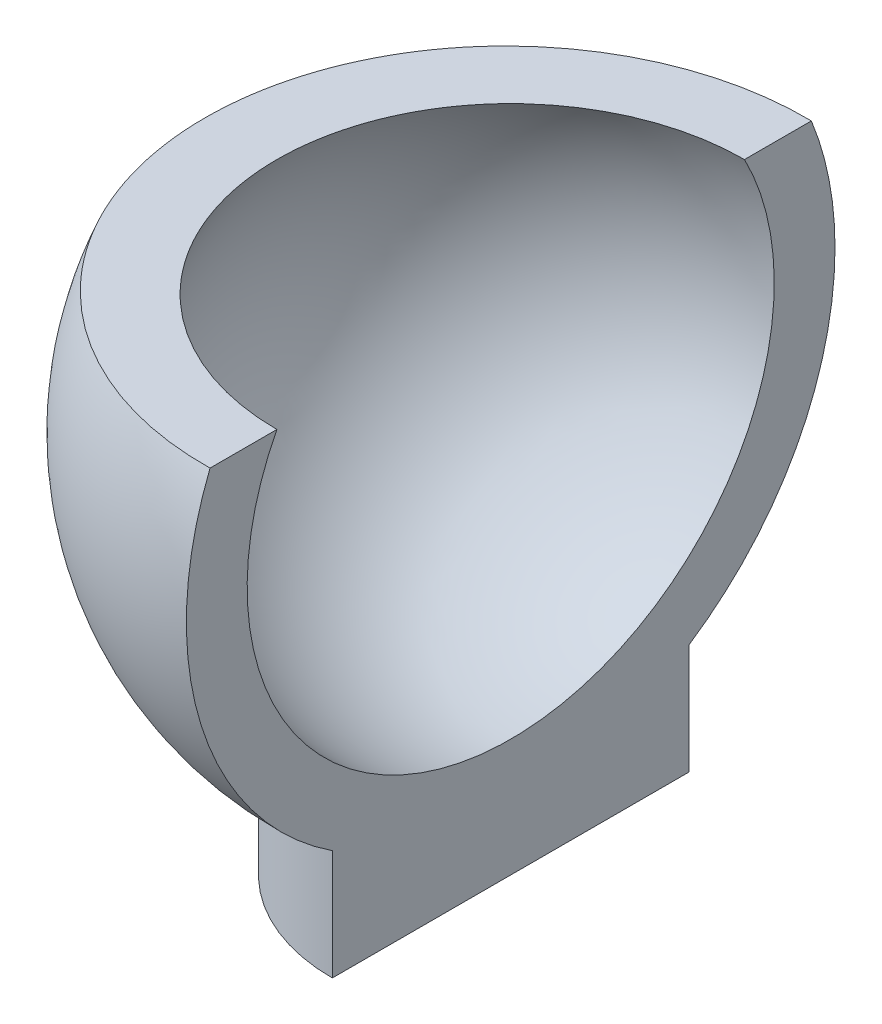
ISO-10303-21;
HEADER;
FILE_DESCRIPTION(('STEP AP214'),'2;1');
FILE_NAME('part.step','',(''),(''),'','','');
FILE_SCHEMA(('AUTOMOTIVE_DESIGN { 1 0 10303 214 1 1 1 1 }'));
ENDSEC;
DATA;
#1=APPLICATION_CONTEXT('core data for automotive mechanical design processes');
#2=APPLICATION_PROTOCOL_DEFINITION('international standard','automotive_design',2000,#1);
#3=PRODUCT_CONTEXT('',#1,'mechanical');
#4=PRODUCT('Part','Part','',(#3));
#5=PRODUCT_RELATED_PRODUCT_CATEGORY('part','',(#4));
#6=PRODUCT_DEFINITION_FORMATION('','',#4);
#7=PRODUCT_DEFINITION_CONTEXT('part definition',#1,'design');
#8=PRODUCT_DEFINITION('design','',#6,#7);
#9=PRODUCT_DEFINITION_SHAPE('','',#8);
#10=(LENGTH_UNIT() NAMED_UNIT(*) SI_UNIT(.MILLI.,.METRE.));
#11=(NAMED_UNIT(*) PLANE_ANGLE_UNIT() SI_UNIT($,.RADIAN.));
#12=(NAMED_UNIT(*) SI_UNIT($,.STERADIAN.) SOLID_ANGLE_UNIT());
#13=UNCERTAINTY_MEASURE_WITH_UNIT(LENGTH_MEASURE(1.E-05),#10,'distance_accuracy_value','');
#14=(GEOMETRIC_REPRESENTATION_CONTEXT(3) GLOBAL_UNCERTAINTY_ASSIGNED_CONTEXT((#13)) GLOBAL_UNIT_ASSIGNED_CONTEXT((#10,
#11,#12)) REPRESENTATION_CONTEXT('',''));
#15=CARTESIAN_POINT('',(0.,0.,0.));
#16=DIRECTION('',(0.,0.,1.));
#17=DIRECTION('',(1.,0.,0.));
#18=AXIS2_PLACEMENT_3D('',#15,#16,#17);
#19=CARTESIAN_POINT('',(-0.318469420270132,0.,0.));
#20=DIRECTION('',(-1.,0.,0.));
#21=DIRECTION('',(0.,0.,-1.));
#22=AXIS2_PLACEMENT_3D('',#19,#20,#21);
#23=SPHERICAL_SURFACE('',#22,20.);
#24=CARTESIAN_POINT('',(-0.318469420270132,7.5,0.));
#25=DIRECTION('',(0.,1.,0.));
#26=DIRECTION('',(0.,0.,1.));
#27=AXIS2_PLACEMENT_3D('',#24,#25,#26);
#28=CIRCLE('',#27,18.5404962177392);
#29=CARTESIAN_POINT('',(0.,7.5,-18.53776084721));
#30=VERTEX_POINT('',#29);
#31=CARTESIAN_POINT('',(0.,7.5,18.53776084721));
#32=VERTEX_POINT('',#31);
#33=EDGE_CURVE('E85',#30,#32,#28,.T.);
#34=ORIENTED_EDGE('',*,*,#33,.F.);
#35=CARTESIAN_POINT('',(0.,0.,0.));
#36=DIRECTION('',(-1.,0.,0.));
#37=DIRECTION('',(0.,0.,1.));
#38=AXIS2_PLACEMENT_3D('',#35,#36,#37);
#39=CIRCLE('',#38,19.9974642699607);
#40=CARTESIAN_POINT('',(0.,-16.7002568012696,-11.));
#41=VERTEX_POINT('',#40);
#42=EDGE_CURVE('E79',#30,#41,#39,.T.);
#43=ORIENTED_EDGE('',*,*,#42,.T.);
#44=CARTESIAN_POINT('',(10.4486910905099,-16.4998,3.43872861608761));
#45=CARTESIAN_POINT('',(10.3520099832137,-16.5016660675455,3.73260385765806));
#46=CARTESIAN_POINT('',(10.2428717104174,-16.5037722891326,4.02237271646154));
#47=CARTESIAN_POINT('',(10.0005990145659,-16.5084467140785,4.59167935130273));
#48=CARTESIAN_POINT('',(9.8674657602793,-16.5110148949357,4.87121762486325));
#49=CARTESIAN_POINT('',(9.57821442973688,-16.5165931160298,5.41787961061132));
#50=CARTESIAN_POINT('',(9.42211274310275,-16.5196028411887,5.68501199792606));
#51=CARTESIAN_POINT('',(9.0879761495767,-16.5260431628054,6.20517762148084));
#52=CARTESIAN_POINT('',(8.90994150481221,-16.5294737542332,6.45821102616962));
#53=CARTESIAN_POINT('',(8.53311257688292,-16.536732433185,6.94849864948354));
#54=CARTESIAN_POINT('',(8.33430864241363,-16.540560705503,7.18574544763739));
#55=CARTESIAN_POINT('',(7.91742485755524,-16.5485853751575,7.64264483067634));
#56=CARTESIAN_POINT('',(7.69934500212475,-16.5527817725904,7.86229741095986));
#57=CARTESIAN_POINT('',(7.24550409597118,-16.5615112018977,8.28240715241219));
#58=CARTESIAN_POINT('',(7.00974645052565,-16.566044168937,8.48286799363849));
#59=CARTESIAN_POINT('',(6.52219028333347,-16.5754144098355,8.86321768096938));
#60=CARTESIAN_POINT('',(6.27039183270186,-16.5802516823456,9.04310661826722));
#61=CARTESIAN_POINT('',(5.75250380402007,-16.5901961666031,9.38106176216871));
#62=CARTESIAN_POINT('',(5.48641208158701,-16.5953034188531,9.53912468149798));
#63=CARTESIAN_POINT('',(4.94186328418899,-16.6057502040994,9.83227363910732));
#64=CARTESIAN_POINT('',(4.66340618668138,-16.6110897375193,9.96735963549719));
#65=CARTESIAN_POINT('',(4.09606315014395,-16.621963334255,10.2136140015553));
#66=CARTESIAN_POINT('',(3.8071756361832,-16.6274974269449,10.3247787414696));
#67=CARTESIAN_POINT('',(3.22106542257375,-16.6387195129622,10.5223752038536));
#68=CARTESIAN_POINT('',(2.92384272576658,-16.6444075062371,10.6088069347547));
#69=CARTESIAN_POINT('',(2.32313838200115,-16.6558972489325,10.7563326448529));
#70=CARTESIAN_POINT('',(2.0196559838272,-16.6616990120022,10.8174235641532));
#71=CARTESIAN_POINT('',(1.40862446542454,-16.6733740937544,10.9138187648366));
#72=CARTESIAN_POINT('',(1.1010753445032,-16.6792474124493,10.9491230418277));
#73=CARTESIAN_POINT('',(0.484115889868616,-16.6910233263341,10.9936928383378));
#74=CARTESIAN_POINT('',(0.174705673000839,-16.696925919682,11.002959975798));
#75=CARTESIAN_POINT('',(-0.443795718501033,-16.7087187637856,10.9953942932697));
#76=CARTESIAN_POINT('',(-0.752886893148376,-16.7146090145417,10.978561474365));
#77=CARTESIAN_POINT('',(-1.3685852901587,-16.7263360226243,10.9189122561017));
#78=CARTESIAN_POINT('',(-1.67519225112046,-16.7321727743296,10.8760931574155));
#79=CARTESIAN_POINT('',(-2.28370988979444,-16.743750902155,10.7647731339014));
#80=CARTESIAN_POINT('',(-2.58562056691049,-16.749492278263,10.6962722058133));
#81=CARTESIAN_POINT('',(-3.18260525764254,-16.7608393084394,10.5340733127363));
#82=CARTESIAN_POINT('',(-3.47767912854026,-16.7664449596747,10.4403748222623));
#83=CARTESIAN_POINT('',(-4.05888541093351,-16.7774810221449,10.2284469860156));
#84=CARTESIAN_POINT('',(-4.34501782288489,-16.7829114333888,10.1102176414936));
#85=CARTESIAN_POINT('',(-4.90629471890557,-16.7935587426303,9.85007334471878));
#86=CARTESIAN_POINT('',(-5.18143965459545,-16.7987756494039,9.70815936722488));
#87=CARTESIAN_POINT('',(-5.71879716220215,-16.8089597297368,9.40165060926966));
#88=CARTESIAN_POINT('',(-5.98100973427018,-16.8139269032989,9.23705582907355));
#89=CARTESIAN_POINT('',(-6.49063565710455,-16.8235768629414,8.88635613533882));
#90=CARTESIAN_POINT('',(-6.73804910295006,-16.8282596508489,8.70025136001687));
#91=CARTESIAN_POINT('',(-7.21631836733921,-16.8373083109268,8.30785342870468));
#92=CARTESIAN_POINT('',(-7.44717418767978,-16.8416741831317,8.10156027490542));
#93=CARTESIAN_POINT('',(-7.8906563429622,-16.8500581692213,7.67028028398163));
#94=CARTESIAN_POINT('',(-8.10328506943565,-16.8540763287293,7.44529590693729));
#95=CARTESIAN_POINT('',(-8.50883410247821,-16.8617377169598,6.97820909767695));
#96=CARTESIAN_POINT('',(-8.70175441040194,-16.865380945708,6.73610666663752));
#97=CARTESIAN_POINT('',(-9.06651386462534,-16.8722673022126,6.23650457808338));
#98=CARTESIAN_POINT('',(-9.23835299298679,-16.8755104296284,5.97900490746725));
#99=CARTESIAN_POINT('',(-9.55972680020424,-16.8815742076838,5.45043935237423));
#100=CARTESIAN_POINT('',(-9.70926148162447,-16.8843948583721,5.17937346945698));
#101=CARTESIAN_POINT('',(-9.9849377666958,-16.8895937983234,4.62565156724651));
#102=CARTESIAN_POINT('',(-10.1110834598625,-16.8919721649192,4.34299758468201));
#103=CARTESIAN_POINT('',(-10.3391162856015,-16.8962707894624,3.76806463740849));
#104=CARTESIAN_POINT('',(-10.4410034209142,-16.8981910474616,3.47578567378682));
#105=CARTESIAN_POINT('',(-10.6197938026897,-16.9015602599419,2.88368130908519));
#106=CARTESIAN_POINT('',(-10.6966970746312,-16.9030092149037,2.58385591570148));
#107=CARTESIAN_POINT('',(-10.8249724111361,-16.9054258765414,1.97879052527897));
#108=CARTESIAN_POINT('',(-10.8763444775881,-16.9063935832529,1.67355052864074));
#109=CARTESIAN_POINT('',(-10.9531862992757,-16.9078410075007,1.05986968490491));
#110=CARTESIAN_POINT('',(-10.9786596779469,-16.9083207933009,0.75142929167029));
#111=CARTESIAN_POINT('',(-11.0035354487566,-16.908789323739,0.133498621511905));
#112=CARTESIAN_POINT('',(-11.0029378435888,-16.9087780684275,-0.175991655303387));
#113=CARTESIAN_POINT('',(-10.9756759096898,-16.9082645940349,-0.793821462876034));
#114=CARTESIAN_POINT('',(-10.9490115917817,-16.9077623751578,-1.10216099411113));
#115=CARTESIAN_POINT('',(-10.869806034012,-16.9062704176933,-1.71549714916166));
#116=CARTESIAN_POINT('',(-10.8172647942037,-16.9052806791069,-2.02049377298399));
#117=CARTESIAN_POINT('',(-10.6866823927888,-16.9028205288884,-2.62496157383));
#118=CARTESIAN_POINT('',(-10.6086424199275,-16.901350139664,-2.92443300774932));
#119=CARTESIAN_POINT('',(-10.4276172303115,-16.8979387667137,-3.51573623907389));
#120=CARTESIAN_POINT('',(-10.324632014827,-16.8959977830118,-3.80756803686811));
#121=CARTESIAN_POINT('',(-10.0944490652742,-16.8916585513587,-4.38151786109732));
#122=CARTESIAN_POINT('',(-9.96725131988663,-16.8892603031939,-4.66363588299111));
#123=CARTESIAN_POINT('',(-9.68954829059844,-16.8840230317175,-5.21615303546429));
#124=CARTESIAN_POINT('',(-9.53904300502315,-16.8811840083742,-5.48655216520169));
#125=CARTESIAN_POINT('',(-9.21578463096101,-16.8750845243206,-6.01372784638748));
#126=CARTESIAN_POINT('',(-9.04303004552077,-16.8718240352536,-6.27050347959168));
#127=CARTESIAN_POINT('',(-8.67650983423113,-16.8649042484251,-6.76858799373889));
#128=CARTESIAN_POINT('',(-8.48274420790317,-16.8612449506547,-7.00989687432962));
#129=CARTESIAN_POINT('',(-8.07558020246493,-16.853552821479,-7.47533328335196));
#130=CARTESIAN_POINT('',(-7.86218184242896,-16.8495199904368,-7.69946082847583));
#131=CARTESIAN_POINT('',(-7.41726965204664,-16.8411086940044,-8.12894281901709));
#132=CARTESIAN_POINT('',(-7.1857558196905,-16.836730228576,-8.33429726235173));
#133=CARTESIAN_POINT('',(-6.70622263113865,-16.8276573376337,-8.72480396613765));
#134=CARTESIAN_POINT('',(-6.45820080190027,-16.822962864778,-8.90995318865352));
#135=CARTESIAN_POINT('',(-5.94744625089713,-16.8132911747974,-9.25869896832882));
#136=CARTESIAN_POINT('',(-5.68471352782633,-16.8083139576473,-9.42229552357478));
#137=CARTESIAN_POINT('',(-5.14640352441548,-16.798111427797,-9.72677503874337));
#138=CARTESIAN_POINT('',(-4.87082617205261,-16.7928861137056,-9.86765787128513));
#139=CARTESIAN_POINT('',(-4.30878713948868,-16.782223914907,-10.1257085148584));
#140=CARTESIAN_POINT('',(-4.02232545801481,-16.7767870301751,-10.2428763231167));
#141=CARTESIAN_POINT('',(-3.44050223296918,-16.7657387922299,-10.4526836562041));
#142=CARTESIAN_POINT('',(-3.14513912416919,-16.7601274083272,-10.5453188388522));
#143=CARTESIAN_POINT('',(-2.54766110912213,-16.748770515582,-10.7053758675295));
#144=CARTESIAN_POINT('',(-2.24554620210348,-16.7430250067243,-10.7727977106772));
#145=CARTESIAN_POINT('',(-1.63671609550183,-16.731440428984,-10.8819486386248));
#146=CARTESIAN_POINT('',(-1.33000095610911,-16.7256013613257,-10.9236780592889));
#147=CARTESIAN_POINT('',(-0.714146537759701,-16.7138708651346,-10.9811492859176));
#148=CARTESIAN_POINT('',(-0.405007258785045,-16.7079794366014,-10.9968910916895));
#149=CARTESIAN_POINT('',(0.213532674233275,-16.6961853353722,-11.0022756535453));
#150=CARTESIAN_POINT('',(0.522933353489004,-16.6902826615002,-10.9919155113116));
#151=CARTESIAN_POINT('',(1.13976234949737,-16.6785087156003,-10.9451636698207));
#152=CARTESIAN_POINT('',(1.44719066575797,-16.6726374435804,-10.9087719640699));
#153=CARTESIAN_POINT('',(2.05789829867899,-16.6609680366465,-10.8102140010129));
#154=CARTESIAN_POINT('',(2.36117749380162,-16.6551699038755,-10.7480469903483));
#155=CARTESIAN_POINT('',(2.96142125439994,-16.6436884724156,-10.5983799370239));
#156=CARTESIAN_POINT('',(3.25838582392825,-16.6380051736531,-10.5108799106228));
#157=CARTESIAN_POINT('',(3.84388957225686,-16.6267942215232,-10.3111681201724));
#158=CARTESIAN_POINT('',(4.13242873475546,-16.6212665684569,-10.1989563083137));
#159=CARTESIAN_POINT('',(4.69903000528824,-16.6104067378104,-9.9506177944535));
#160=CARTESIAN_POINT('',(4.97709208412435,-16.6050745607748,-9.81449102581059));
#161=CARTESIAN_POINT('',(5.52075881460794,-16.5946442782144,-9.5192909763738));
#162=CARTESIAN_POINT('',(5.78636355213812,-16.5895461710758,-9.36021785380619));
#163=CARTESIAN_POINT('',(6.30322539774932,-16.5796210083792,-9.02025654221474));
#164=CARTESIAN_POINT('',(6.55448267310545,-16.574793949661,-8.83936860760338));
#165=CARTESIAN_POINT('',(7.04088092854326,-16.5654456188017,-8.45704976555997));
#166=CARTESIAN_POINT('',(7.27602086489207,-16.5609243664643,-8.2556175298097));
#167=CARTESIAN_POINT('',(7.72849669721531,-16.5522208917737,-7.83364760966612));
#168=CARTESIAN_POINT('',(7.94583239766744,-16.5480386731438,-7.61310971551327));
#169=CARTESIAN_POINT('',(8.36109707607647,-16.5400449130939,-7.15455940115801));
#170=CARTESIAN_POINT('',(8.55903063703988,-16.5362332841383,-6.91655113099988));
#171=CARTESIAN_POINT('',(8.93411995155831,-16.5290079037086,-6.42472626270363));
#172=CARTESIAN_POINT('',(9.11127951094772,-16.5255940793569,-6.17091257323262));
#173=CARTESIAN_POINT('',(9.40026441544679,-16.5200238897408,-5.71728382909163));
#174=CARTESIAN_POINT('',(9.51708571530023,-16.517771648658,-5.52063038839268));
#175=CARTESIAN_POINT('',(9.73824866419202,-16.5135069854942,-5.12042679288211));
#176=CARTESIAN_POINT('',(9.84259108842962,-16.5114945485165,-4.9168770674832));
#177=CARTESIAN_POINT('',(10.0382688967867,-16.5077199348344,-4.50391941420344));
#178=CARTESIAN_POINT('',(10.1296197512353,-16.5059574604823,-4.29451881531439));
#179=CARTESIAN_POINT('',(10.2991369791872,-16.5026864327178,-3.87039995169055));
#180=CARTESIAN_POINT('',(10.3773008767033,-16.5011779269909,-3.65568069698354));
#181=CARTESIAN_POINT('',(10.4486910905099,-16.4998,-3.43872861608745));
#182=B_SPLINE_CURVE_WITH_KNOTS('',3,(#44,#45,#46,#47,#48,#49,#50,#51,#52,#53,#54,#55,#56,#57,
#58,#59,#60,#61,#62,#63,#64,#65,#66,#67,#68,#69,#70,#71,#72,#73,#74,#75,#76,#77,#78,#79,#80,#81,
#82,#83,#84,#85,#86,#87,#88,#89,#90,#91,#92,#93,#94,#95,#96,#97,#98,#99,#100,#101,#102,#103,
#104,#105,#106,#107,#108,#109,#110,#111,#112,#113,#114,#115,#116,#117,#118,#119,#120,#121,#122,
#123,#124,#125,#126,#127,#128,#129,#130,#131,#132,#133,#134,#135,#136,#137,#138,#139,#140,#141,
#142,#143,#144,#145,#146,#147,#148,#149,#150,#151,#152,#153,#154,#155,#156,#157,#158,#159,#160,
#161,#162,#163,#164,#165,#166,#167,#168,#169,#170,#171,#172,#173,#174,#175,#176,#177,#178,#179,
#180,#181),.UNSPECIFIED.,.F.,.F.,(4,2,2,2,2,2,2,2,2,2,2,2,2,2,2,2,2,2,2,2,2,2,2,2,2,2,2,2,2,2,2,
2,2,2,2,2,2,2,2,2,2,2,2,2,2,2,2,2,2,2,2,2,2,2,2,2,2,2,2,2,2,2,2,2,2,2,2,2,4),(0.,
0.927843860370731,1.85564253871705,2.78278234845758,3.70991107874351,4.63747257018442,
5.5650343042185,6.49241781854272,7.41979722170599,8.34731614794359,9.27483676516145,
10.2024980230381,11.1301589646726,12.0579318885529,12.9857049704517,13.91342039949,
14.8411357900027,15.7689475635491,16.6967594548774,17.6245906968549,18.5524218915296,
19.4802149100238,20.4080079176697,21.3357949639321,22.2635819095047,23.1912469355407,
24.1189118978158,25.0465776494469,25.974243294429,26.9017465857402,27.8292497722707,
28.7567520129226,29.684254184961,30.61162657409,31.5389988674037,32.4663707756706,
33.3937426820275,34.3210713606843,35.2483999921254,36.1757290570883,37.1030581886793,
38.0304497444541,38.9578413213519,39.8852319972454,40.8126227760272,41.740152800151,
42.6676829066212,43.5952182145935,44.5227536310316,45.4504531081423,46.37815269127,
47.3058401467805,48.2335276091697,49.1613180849998,50.0891087922684,51.0169266188301,
51.9447438499175,52.8725628760531,53.8003844876913,54.7281997018534,55.6560040965343,
56.583868517677,57.5117431270622,58.4393980310464,59.3668827205889,60.0527055224225,
60.7384856981572,61.423442285364,62.1085273374436),.UNSPECIFIED.);
#183=CARTESIAN_POINT('',(0.,-16.7002568012696,11.));
#184=VERTEX_POINT('',#183);
#185=EDGE_CURVE('E42',#184,#41,#182,.T.);
#186=ORIENTED_EDGE('',*,*,#185,.F.);
#187=EDGE_CURVE('E120',#184,#32,#39,.T.);
#188=ORIENTED_EDGE('',*,*,#187,.T.);
#189=EDGE_LOOP('',(#34,#43,#186,#188));
#190=FACE_BOUND('',#189,.T.);
#191=ADVANCED_FACE('F34',(#190),#23,.T.);
#192=CARTESIAN_POINT('',(0.,7.5,0.));
#193=DIRECTION('',(0.,1.,0.));
#194=DIRECTION('',(0.,0.,1.));
#195=AXIS2_PLACEMENT_3D('',#192,#193,#194);
#196=PLANE('',#195);
#197=DIRECTION('',(0.,0.,1.));
#198=VECTOR('',#197,1.);
#199=CARTESIAN_POINT('',(0.,7.5,0.));
#200=LINE('',#199,#198);
#201=CARTESIAN_POINT('',(0.,7.5,-14.4157032433385));
#202=VERTEX_POINT('',#201);
#203=EDGE_CURVE('E112',#30,#202,#200,.T.);
#204=ORIENTED_EDGE('',*,*,#203,.F.);
#205=ORIENTED_EDGE('',*,*,#33,.T.);
#206=CARTESIAN_POINT('',(0.,7.5,14.4157032433385));
#207=VERTEX_POINT('',#206);
#208=EDGE_CURVE('E118',#207,#32,#200,.T.);
#209=ORIENTED_EDGE('',*,*,#208,.F.);
#210=CARTESIAN_POINT('',(0.,7.5,0.));
#211=DIRECTION('',(0.,1.,0.));
#212=DIRECTION('',(0.,0.,1.));
#213=AXIS2_PLACEMENT_3D('',#210,#211,#212);
#214=CIRCLE('',#213,14.4157032433385);
#215=EDGE_CURVE('E82',#202,#207,#214,.T.);
#216=ORIENTED_EDGE('',*,*,#215,.F.);
#217=EDGE_LOOP('',(#204,#205,#209,#216));
#218=FACE_BOUND('',#217,.T.);
#219=ADVANCED_FACE('F102',(#218),#196,.T.);
#220=CARTESIAN_POINT('',(0.,0.,0.));
#221=DIRECTION('',(-1.,0.,0.));
#222=DIRECTION('',(0.,1.,0.));
#223=AXIS2_PLACEMENT_3D('',#220,#221,#222);
#224=SPHERICAL_SURFACE('',#223,16.25);
#225=ORIENTED_EDGE('',*,*,#215,.T.);
#226=CARTESIAN_POINT('',(0.,0.,0.));
#227=DIRECTION('',(-1.,0.,0.));
#228=DIRECTION('',(0.,0.,1.));
#229=AXIS2_PLACEMENT_3D('',#226,#227,#228);
#230=CIRCLE('',#229,16.25);
#231=EDGE_CURVE('E116',#207,#202,#230,.F.);
#232=ORIENTED_EDGE('',*,*,#231,.T.);
#233=EDGE_LOOP('',(#225,#232));
#234=FACE_BOUND('',#233,.T.);
#235=ADVANCED_FACE('F99',(#234),#224,.F.);
#236=CARTESIAN_POINT('',(0.,-16.5,0.));
#237=DIRECTION('',(0.,-1.,0.));
#238=DIRECTION('',(0.,0.,-1.));
#239=AXIS2_PLACEMENT_3D('',#236,#237,#238);
#240=CYLINDRICAL_SURFACE('',#239,11.);
#241=ORIENTED_EDGE('',*,*,#185,.T.);
#242=DIRECTION('',(0.,-1.,0.));
#243=VECTOR('',#242,1.);
#244=CARTESIAN_POINT('',(0.,-16.5,-11.));
#245=LINE('',#244,#243);
#246=CARTESIAN_POINT('',(0.,-23.5,-11.));
#247=VERTEX_POINT('',#246);
#248=EDGE_CURVE('E54',#41,#247,#245,.T.);
#249=ORIENTED_EDGE('',*,*,#248,.T.);
#250=CARTESIAN_POINT('',(0.,-23.5,0.));
#251=DIRECTION('',(0.,1.,0.));
#252=DIRECTION('',(0.,0.,1.));
#253=AXIS2_PLACEMENT_3D('',#250,#251,#252);
#254=CIRCLE('',#253,11.);
#255=CARTESIAN_POINT('',(0.,-23.5,11.));
#256=VERTEX_POINT('',#255);
#257=EDGE_CURVE('E77',#247,#256,#254,.T.);
#258=ORIENTED_EDGE('',*,*,#257,.T.);
#259=DIRECTION('',(0.,-1.,0.));
#260=VECTOR('',#259,1.);
#261=CARTESIAN_POINT('',(0.,-16.5,11.));
#262=LINE('',#261,#260);
#263=EDGE_CURVE('E49',#256,#184,#262,.F.);
#264=ORIENTED_EDGE('',*,*,#263,.T.);
#265=EDGE_LOOP('',(#241,#249,#258,#264));
#266=FACE_BOUND('',#265,.T.);
#267=ADVANCED_FACE('F76',(#266),#240,.T.);
#268=CARTESIAN_POINT('',(0.,-23.5,0.));
#269=DIRECTION('',(0.,1.,0.));
#270=DIRECTION('',(0.,0.,1.));
#271=AXIS2_PLACEMENT_3D('',#268,#269,#270);
#272=PLANE('',#271);
#273=ORIENTED_EDGE('',*,*,#257,.F.);
#274=DIRECTION('',(0.,0.,1.));
#275=VECTOR('',#274,1.);
#276=CARTESIAN_POINT('',(0.,-23.5,0.));
#277=LINE('',#276,#275);
#278=EDGE_CURVE('E11',#247,#256,#277,.T.);
#279=ORIENTED_EDGE('',*,*,#278,.T.);
#280=EDGE_LOOP('',(#273,#279));
#281=FACE_BOUND('',#280,.T.);
#282=ADVANCED_FACE('F81',(#281),#272,.F.);
#283=CARTESIAN_POINT('',(0.,16.5,-21.0145871077321));
#284=DIRECTION('',(-1.,0.,0.));
#285=DIRECTION('',(0.,0.,1.));
#286=AXIS2_PLACEMENT_3D('',#283,#284,#285);
#287=PLANE('',#286);
#288=ORIENTED_EDGE('',*,*,#42,.F.);
#289=ORIENTED_EDGE('',*,*,#203,.T.);
#290=ORIENTED_EDGE('',*,*,#231,.F.);
#291=ORIENTED_EDGE('',*,*,#208,.T.);
#292=ORIENTED_EDGE('',*,*,#187,.F.);
#293=ORIENTED_EDGE('',*,*,#263,.F.);
#294=ORIENTED_EDGE('',*,*,#278,.F.);
#295=ORIENTED_EDGE('',*,*,#248,.F.);
#296=EDGE_LOOP('',(#288,#289,#290,#291,#292,#293,#294,#295));
#297=FACE_BOUND('',#296,.T.);
#298=ADVANCED_FACE('F70',(#297),#287,.F.);
#299=CLOSED_SHELL('',(#191,#219,#235,#267,#282,#298));
#300=MANIFOLD_SOLID_BREP('B2',#299);
#301=ADVANCED_BREP_SHAPE_REPRESENTATION('',(#18,#300),#14);
#302=SHAPE_DEFINITION_REPRESENTATION(#9,#301);
ENDSEC;
END-ISO-10303-21;
